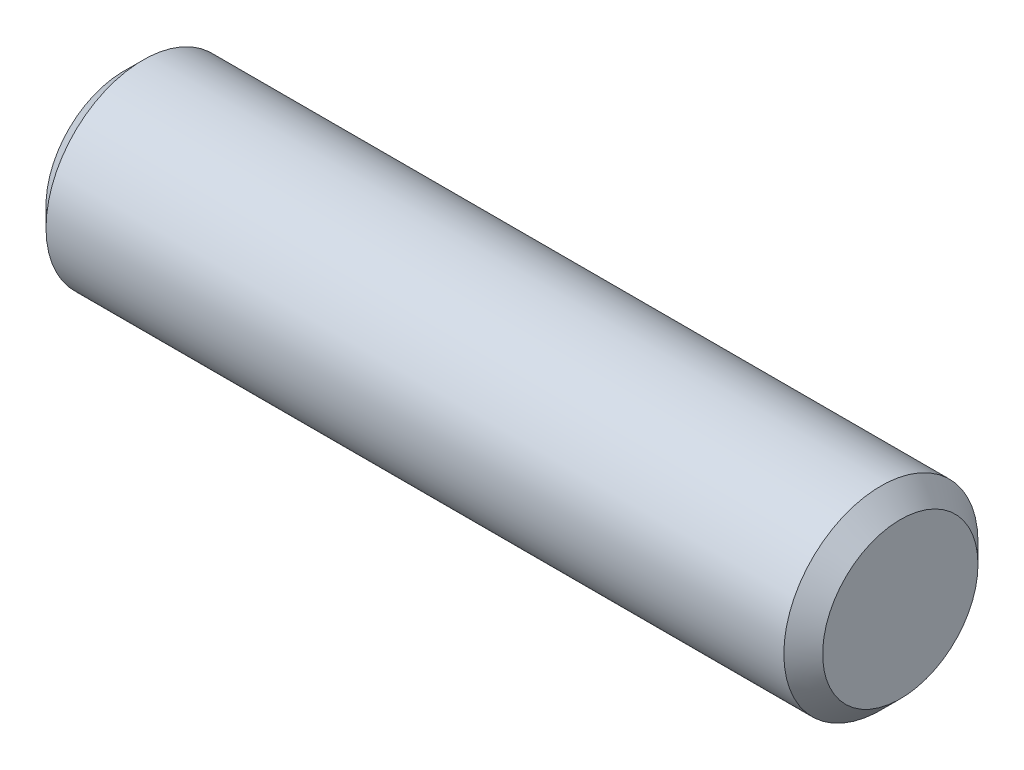
ISO-10303-21;
HEADER;
FILE_DESCRIPTION(('STEP AP214'),'2;1');
FILE_NAME('part.step','',(''),(''),'','','');
FILE_SCHEMA(('AUTOMOTIVE_DESIGN { 1 0 10303 214 1 1 1 1 }'));
ENDSEC;
DATA;
#1=APPLICATION_CONTEXT('core data for automotive mechanical design processes');
#2=APPLICATION_PROTOCOL_DEFINITION('international standard','automotive_design',2000,#1);
#3=PRODUCT_CONTEXT('',#1,'mechanical');
#4=PRODUCT('Part','Part','',(#3));
#5=PRODUCT_RELATED_PRODUCT_CATEGORY('part','',(#4));
#6=PRODUCT_DEFINITION_FORMATION('','',#4);
#7=PRODUCT_DEFINITION_CONTEXT('part definition',#1,'design');
#8=PRODUCT_DEFINITION('design','',#6,#7);
#9=PRODUCT_DEFINITION_SHAPE('','',#8);
#10=(LENGTH_UNIT() NAMED_UNIT(*) SI_UNIT(.MILLI.,.METRE.));
#11=(NAMED_UNIT(*) PLANE_ANGLE_UNIT() SI_UNIT($,.RADIAN.));
#12=(NAMED_UNIT(*) SI_UNIT($,.STERADIAN.) SOLID_ANGLE_UNIT());
#13=UNCERTAINTY_MEASURE_WITH_UNIT(LENGTH_MEASURE(1.E-05),#10,'distance_accuracy_value','');
#14=(GEOMETRIC_REPRESENTATION_CONTEXT(3) GLOBAL_UNCERTAINTY_ASSIGNED_CONTEXT((#13)) GLOBAL_UNIT_ASSIGNED_CONTEXT((#10,
#11,#12)) REPRESENTATION_CONTEXT('',''));
#15=CARTESIAN_POINT('',(0.,0.,0.));
#16=DIRECTION('',(0.,0.,1.));
#17=DIRECTION('',(1.,0.,0.));
#18=AXIS2_PLACEMENT_3D('',#15,#16,#17);
#19=CARTESIAN_POINT('',(-9.525,0.,0.));
#20=DIRECTION('',(1.,0.,0.));
#21=DIRECTION('',(0.,0.,-1.));
#22=AXIS2_PLACEMENT_3D('',#19,#20,#21);
#23=CYLINDRICAL_SURFACE('',#22,2.38125);
#24=CARTESIAN_POINT('',(9.04875,0.,0.));
#25=DIRECTION('',(1.,0.,0.));
#26=DIRECTION('',(0.,0.,-1.));
#27=AXIS2_PLACEMENT_3D('',#24,#25,#26);
#28=CIRCLE('',#27,2.38125);
#29=CARTESIAN_POINT('',(9.04875,0.,-2.38125));
#30=VERTEX_POINT('',#29);
#31=EDGE_CURVE('E37',#30,#30,#28,.F.);
#32=ORIENTED_EDGE('',*,*,#31,.T.);
#33=EDGE_LOOP('',(#32));
#34=FACE_BOUND('',#33,.T.);
#35=CARTESIAN_POINT('',(-9.04875,0.,0.));
#36=DIRECTION('',(1.,0.,0.));
#37=DIRECTION('',(0.,0.,-1.));
#38=AXIS2_PLACEMENT_3D('',#35,#36,#37);
#39=CIRCLE('',#38,2.38125);
#40=CARTESIAN_POINT('',(-9.04875,0.,-2.38125));
#41=VERTEX_POINT('',#40);
#42=EDGE_CURVE('E41',#41,#41,#39,.T.);
#43=ORIENTED_EDGE('',*,*,#42,.T.);
#44=EDGE_LOOP('',(#43));
#45=FACE_BOUND('',#44,.T.);
#46=ADVANCED_FACE('F30',(#34,#45),#23,.T.);
#47=CARTESIAN_POINT('',(-9.525,0.,0.));
#48=DIRECTION('',(1.,0.,0.));
#49=DIRECTION('',(0.,0.,-1.));
#50=AXIS2_PLACEMENT_3D('',#47,#48,#49);
#51=PLANE('',#50);
#52=CARTESIAN_POINT('',(-9.525,0.,0.));
#53=DIRECTION('',(1.,0.,0.));
#54=DIRECTION('',(0.,0.,-1.));
#55=AXIS2_PLACEMENT_3D('',#52,#53,#54);
#56=CIRCLE('',#55,1.905);
#57=CARTESIAN_POINT('',(-9.525,0.,-1.905));
#58=VERTEX_POINT('',#57);
#59=EDGE_CURVE('E10',#58,#58,#56,.F.);
#60=ORIENTED_EDGE('',*,*,#59,.T.);
#61=EDGE_LOOP('',(#60));
#62=FACE_BOUND('',#61,.T.);
#63=ADVANCED_FACE('F61',(#62),#51,.F.);
#64=CARTESIAN_POINT('',(9.525,0.,0.));
#65=DIRECTION('',(1.,0.,0.));
#66=DIRECTION('',(0.,0.,-1.));
#67=AXIS2_PLACEMENT_3D('',#64,#65,#66);
#68=PLANE('',#67);
#69=CARTESIAN_POINT('',(9.525,0.,0.));
#70=DIRECTION('',(1.,0.,0.));
#71=DIRECTION('',(0.,0.,-1.));
#72=AXIS2_PLACEMENT_3D('',#69,#70,#71);
#73=CIRCLE('',#72,1.905);
#74=CARTESIAN_POINT('',(9.525,0.,-1.905));
#75=VERTEX_POINT('',#74);
#76=EDGE_CURVE('E45',#75,#75,#73,.T.);
#77=ORIENTED_EDGE('',*,*,#76,.T.);
#78=EDGE_LOOP('',(#77));
#79=FACE_BOUND('',#78,.T.);
#80=ADVANCED_FACE('F51',(#79),#68,.T.);
#81=CARTESIAN_POINT('',(9.525,0.,0.));
#82=DIRECTION('',(-1.,0.,0.));
#83=DIRECTION('',(0.,0.,1.));
#84=AXIS2_PLACEMENT_3D('',#81,#82,#83);
#85=CONICAL_SURFACE('',#84,1.905,0.785398163397451);
#86=ORIENTED_EDGE('',*,*,#31,.F.);
#87=EDGE_LOOP('',(#86));
#88=FACE_BOUND('',#87,.T.);
#89=ORIENTED_EDGE('',*,*,#76,.F.);
#90=EDGE_LOOP('',(#89));
#91=FACE_BOUND('',#90,.T.);
#92=ADVANCED_FACE('F53',(#88,#91),#85,.T.);
#93=CARTESIAN_POINT('',(-9.04875,0.,0.));
#94=DIRECTION('',(1.,0.,0.));
#95=DIRECTION('',(0.,0.,-1.));
#96=AXIS2_PLACEMENT_3D('',#93,#94,#95);
#97=CONICAL_SURFACE('',#96,2.38125,0.785398163397451);
#98=ORIENTED_EDGE('',*,*,#59,.F.);
#99=EDGE_LOOP('',(#98));
#100=FACE_BOUND('',#99,.T.);
#101=ORIENTED_EDGE('',*,*,#42,.F.);
#102=EDGE_LOOP('',(#101));
#103=FACE_BOUND('',#102,.T.);
#104=ADVANCED_FACE('F32',(#100,#103),#97,.T.);
#105=CLOSED_SHELL('',(#46,#63,#80,#92,#104));
#106=MANIFOLD_SOLID_BREP('B2',#105);
#107=ADVANCED_BREP_SHAPE_REPRESENTATION('',(#18,#106),#14);
#108=SHAPE_DEFINITION_REPRESENTATION(#9,#107);
ENDSEC;
END-ISO-10303-21;
